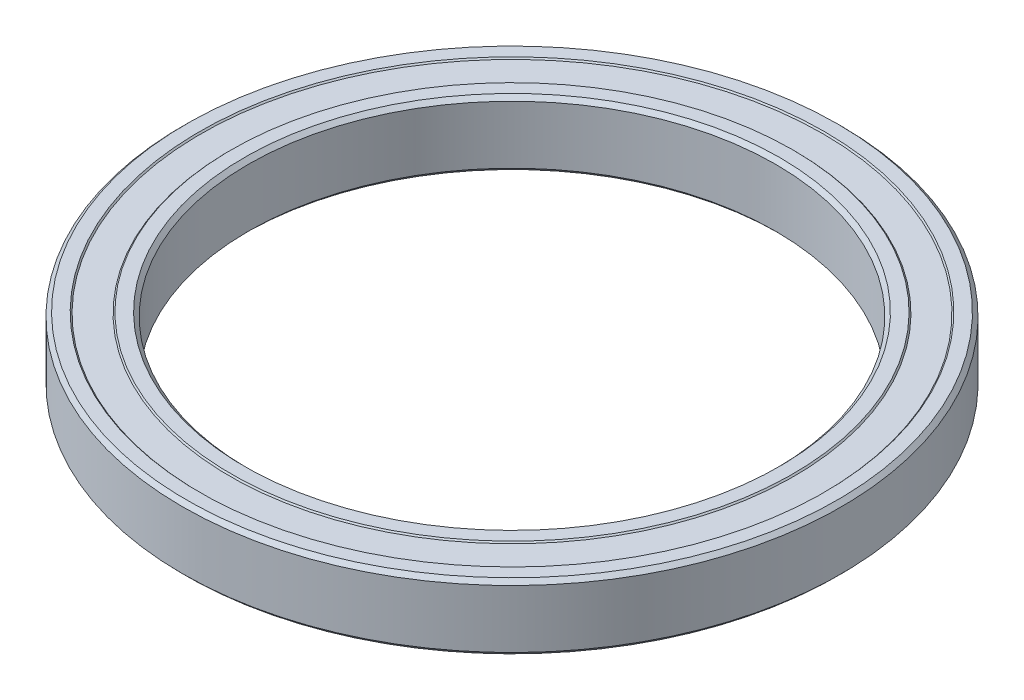
ISO-10303-21;
HEADER;
FILE_DESCRIPTION(('STEP AP214'),'2;1');
FILE_NAME('part.step','',(''),(''),'','','');
FILE_SCHEMA(('AUTOMOTIVE_DESIGN { 1 0 10303 214 1 1 1 1 }'));
ENDSEC;
DATA;
#1=APPLICATION_CONTEXT('core data for automotive mechanical design processes');
#2=APPLICATION_PROTOCOL_DEFINITION('international standard','automotive_design',2000,#1);
#3=PRODUCT_CONTEXT('',#1,'mechanical');
#4=PRODUCT('Part','Part','',(#3));
#5=PRODUCT_RELATED_PRODUCT_CATEGORY('part','',(#4));
#6=PRODUCT_DEFINITION_FORMATION('','',#4);
#7=PRODUCT_DEFINITION_CONTEXT('part definition',#1,'design');
#8=PRODUCT_DEFINITION('design','',#6,#7);
#9=PRODUCT_DEFINITION_SHAPE('','',#8);
#10=(LENGTH_UNIT() NAMED_UNIT(*) SI_UNIT(.MILLI.,.METRE.));
#11=(NAMED_UNIT(*) PLANE_ANGLE_UNIT() SI_UNIT($,.RADIAN.));
#12=(NAMED_UNIT(*) SI_UNIT($,.STERADIAN.) SOLID_ANGLE_UNIT());
#13=UNCERTAINTY_MEASURE_WITH_UNIT(LENGTH_MEASURE(1.E-05),#10,'distance_accuracy_value','');
#14=(GEOMETRIC_REPRESENTATION_CONTEXT(3) GLOBAL_UNCERTAINTY_ASSIGNED_CONTEXT((#13)) GLOBAL_UNIT_ASSIGNED_CONTEXT((#10,
#11,#12)) REPRESENTATION_CONTEXT('',''));
#15=CARTESIAN_POINT('',(0.,0.,0.));
#16=DIRECTION('',(0.,0.,1.));
#17=DIRECTION('',(1.,0.,0.));
#18=AXIS2_PLACEMENT_3D('',#15,#16,#17);
#19=CARTESIAN_POINT('',(0.,5.,0.));
#20=DIRECTION('',(0.,1.,0.));
#21=DIRECTION('',(0.,0.,1.));
#22=AXIS2_PLACEMENT_3D('',#19,#20,#21);
#23=CONICAL_SURFACE('',#22,40.6,0.785398163397448);
#24=CARTESIAN_POINT('',(0.,4.4,0.));
#25=DIRECTION('',(0.,-1.,0.));
#26=DIRECTION('',(0.,0.,-1.));
#27=AXIS2_PLACEMENT_3D('',#24,#25,#26);
#28=CIRCLE('',#27,40.);
#29=CARTESIAN_POINT('',(0.,4.4,-40.));
#30=VERTEX_POINT('',#29);
#31=EDGE_CURVE('E10',#30,#30,#28,.T.);
#32=ORIENTED_EDGE('',*,*,#31,.T.);
#33=EDGE_LOOP('',(#32));
#34=FACE_BOUND('',#33,.T.);
#35=CARTESIAN_POINT('',(0.,5.,0.));
#36=DIRECTION('',(0.,-1.,0.));
#37=DIRECTION('',(0.,0.,-1.));
#38=AXIS2_PLACEMENT_3D('',#35,#36,#37);
#39=CIRCLE('',#38,40.6);
#40=CARTESIAN_POINT('',(0.,5.,-40.6));
#41=VERTEX_POINT('',#40);
#42=EDGE_CURVE('E88',#41,#41,#39,.T.);
#43=ORIENTED_EDGE('',*,*,#42,.F.);
#44=EDGE_LOOP('',(#43));
#45=FACE_BOUND('',#44,.T.);
#46=ADVANCED_FACE('F36',(#34,#45),#23,.F.);
#47=CARTESIAN_POINT('',(0.,-1.34942197217015,0.));
#48=DIRECTION('',(0.,-1.,0.));
#49=DIRECTION('',(0.,0.,-1.));
#50=AXIS2_PLACEMENT_3D('',#47,#48,#49);
#51=CYLINDRICAL_SURFACE('',#50,40.);
#52=CARTESIAN_POINT('',(0.,-4.4,0.));
#53=DIRECTION('',(0.,-1.,0.));
#54=DIRECTION('',(0.,0.,-1.));
#55=AXIS2_PLACEMENT_3D('',#52,#53,#54);
#56=CIRCLE('',#55,40.);
#57=CARTESIAN_POINT('',(0.,-4.4,-40.));
#58=VERTEX_POINT('',#57);
#59=EDGE_CURVE('E42',#58,#58,#56,.T.);
#60=ORIENTED_EDGE('',*,*,#59,.T.);
#61=EDGE_LOOP('',(#60));
#62=FACE_BOUND('',#61,.T.);
#63=ORIENTED_EDGE('',*,*,#31,.F.);
#64=EDGE_LOOP('',(#63));
#65=FACE_BOUND('',#64,.T.);
#66=ADVANCED_FACE('F96',(#62,#65),#51,.F.);
#67=CARTESIAN_POINT('',(0.,-4.4,0.));
#68=DIRECTION('',(0.,-1.,0.));
#69=DIRECTION('',(0.,0.,-1.));
#70=AXIS2_PLACEMENT_3D('',#67,#68,#69);
#71=CONICAL_SURFACE('',#70,40.,0.78539816339745);
#72=CARTESIAN_POINT('',(0.,-5.,0.));
#73=DIRECTION('',(0.,-1.,0.));
#74=DIRECTION('',(0.,0.,-1.));
#75=AXIS2_PLACEMENT_3D('',#72,#73,#74);
#76=CIRCLE('',#75,40.6);
#77=CARTESIAN_POINT('',(0.,-5.,-40.6));
#78=VERTEX_POINT('',#77);
#79=EDGE_CURVE('E46',#78,#78,#76,.T.);
#80=ORIENTED_EDGE('',*,*,#79,.T.);
#81=EDGE_LOOP('',(#80));
#82=FACE_BOUND('',#81,.T.);
#83=ORIENTED_EDGE('',*,*,#59,.F.);
#84=EDGE_LOOP('',(#83));
#85=FACE_BOUND('',#84,.T.);
#86=ADVANCED_FACE('F100',(#82,#85),#71,.F.);
#87=CARTESIAN_POINT('',(40.6,-5.,0.));
#88=DIRECTION('',(0.,-1.,0.));
#89=DIRECTION('',(0.,0.,-1.));
#90=AXIS2_PLACEMENT_3D('',#87,#88,#89);
#91=PLANE('',#90);
#92=CARTESIAN_POINT('',(0.,-5.,0.));
#93=DIRECTION('',(0.,-1.,0.));
#94=DIRECTION('',(0.,0.,-1.));
#95=AXIS2_PLACEMENT_3D('',#92,#93,#94);
#96=CIRCLE('',#95,42.6);
#97=CARTESIAN_POINT('',(0.,-5.,-42.6));
#98=VERTEX_POINT('',#97);
#99=EDGE_CURVE('E50',#98,#98,#96,.T.);
#100=ORIENTED_EDGE('',*,*,#99,.T.);
#101=EDGE_LOOP('',(#100));
#102=FACE_BOUND('',#101,.T.);
#103=ORIENTED_EDGE('',*,*,#79,.F.);
#104=EDGE_LOOP('',(#103));
#105=FACE_BOUND('',#104,.T.);
#106=ADVANCED_FACE('F104',(#102,#105),#91,.T.);
#107=CARTESIAN_POINT('',(0.,-5.,0.));
#108=DIRECTION('',(0.,1.,0.));
#109=DIRECTION('',(0.,0.,1.));
#110=AXIS2_PLACEMENT_3D('',#107,#108,#109);
#111=CONICAL_SURFACE('',#110,42.6,0.785398163397446);
#112=CARTESIAN_POINT('',(0.,-4.8,0.));
#113=DIRECTION('',(0.,-1.,0.));
#114=DIRECTION('',(0.,0.,-1.));
#115=AXIS2_PLACEMENT_3D('',#112,#113,#114);
#116=CIRCLE('',#115,42.8);
#117=CARTESIAN_POINT('',(0.,-4.8,-42.8));
#118=VERTEX_POINT('',#117);
#119=EDGE_CURVE('E55',#118,#118,#116,.T.);
#120=ORIENTED_EDGE('',*,*,#119,.T.);
#121=EDGE_LOOP('',(#120));
#122=FACE_BOUND('',#121,.T.);
#123=ORIENTED_EDGE('',*,*,#99,.F.);
#124=EDGE_LOOP('',(#123));
#125=FACE_BOUND('',#124,.T.);
#126=ADVANCED_FACE('F111',(#122,#125),#111,.T.);
#127=CARTESIAN_POINT('',(42.8,-4.8,0.));
#128=DIRECTION('',(0.,-1.,0.));
#129=DIRECTION('',(0.,0.,-1.));
#130=AXIS2_PLACEMENT_3D('',#127,#128,#129);
#131=PLANE('',#130);
#132=CARTESIAN_POINT('',(0.,-4.8,0.));
#133=DIRECTION('',(0.,-1.,0.));
#134=DIRECTION('',(0.,0.,-1.));
#135=AXIS2_PLACEMENT_3D('',#132,#133,#134);
#136=CIRCLE('',#135,47.2);
#137=CARTESIAN_POINT('',(0.,-4.8,-47.2));
#138=VERTEX_POINT('',#137);
#139=EDGE_CURVE('E58',#138,#138,#136,.T.);
#140=ORIENTED_EDGE('',*,*,#139,.T.);
#141=EDGE_LOOP('',(#140));
#142=FACE_BOUND('',#141,.T.);
#143=ORIENTED_EDGE('',*,*,#119,.F.);
#144=EDGE_LOOP('',(#143));
#145=FACE_BOUND('',#144,.T.);
#146=ADVANCED_FACE('F115',(#142,#145),#131,.T.);
#147=CARTESIAN_POINT('',(0.,-4.8,0.));
#148=DIRECTION('',(0.,-1.,0.));
#149=DIRECTION('',(0.,0.,-1.));
#150=AXIS2_PLACEMENT_3D('',#147,#148,#149);
#151=CONICAL_SURFACE('',#150,47.2,0.785398163397444);
#152=CARTESIAN_POINT('',(0.,-5.,0.));
#153=DIRECTION('',(0.,-1.,0.));
#154=DIRECTION('',(0.,0.,-1.));
#155=AXIS2_PLACEMENT_3D('',#152,#153,#154);
#156=CIRCLE('',#155,47.4);
#157=CARTESIAN_POINT('',(0.,-5.,-47.4));
#158=VERTEX_POINT('',#157);
#159=EDGE_CURVE('E61',#158,#158,#156,.T.);
#160=ORIENTED_EDGE('',*,*,#159,.T.);
#161=EDGE_LOOP('',(#160));
#162=FACE_BOUND('',#161,.T.);
#163=ORIENTED_EDGE('',*,*,#139,.F.);
#164=EDGE_LOOP('',(#163));
#165=FACE_BOUND('',#164,.T.);
#166=ADVANCED_FACE('F119',(#162,#165),#151,.F.);
#167=CARTESIAN_POINT('',(47.4,-5.,0.));
#168=DIRECTION('',(0.,-1.,0.));
#169=DIRECTION('',(0.,0.,-1.));
#170=AXIS2_PLACEMENT_3D('',#167,#168,#169);
#171=PLANE('',#170);
#172=CARTESIAN_POINT('',(0.,-5.,0.));
#173=DIRECTION('',(0.,-1.,0.));
#174=DIRECTION('',(0.,0.,-1.));
#175=AXIS2_PLACEMENT_3D('',#172,#173,#174);
#176=CIRCLE('',#175,49.4);
#177=CARTESIAN_POINT('',(0.,-5.,-49.4));
#178=VERTEX_POINT('',#177);
#179=EDGE_CURVE('E64',#178,#178,#176,.T.);
#180=ORIENTED_EDGE('',*,*,#179,.T.);
#181=EDGE_LOOP('',(#180));
#182=FACE_BOUND('',#181,.T.);
#183=ORIENTED_EDGE('',*,*,#159,.F.);
#184=EDGE_LOOP('',(#183));
#185=FACE_BOUND('',#184,.T.);
#186=ADVANCED_FACE('F123',(#182,#185),#171,.T.);
#187=CARTESIAN_POINT('',(0.,-5.,0.));
#188=DIRECTION('',(0.,1.,0.));
#189=DIRECTION('',(0.,0.,1.));
#190=AXIS2_PLACEMENT_3D('',#187,#188,#189);
#191=CONICAL_SURFACE('',#190,49.4,0.78539816339744);
#192=CARTESIAN_POINT('',(0.,-4.39999999999999,0.));
#193=DIRECTION('',(0.,-1.,0.));
#194=DIRECTION('',(0.,0.,-1.));
#195=AXIS2_PLACEMENT_3D('',#192,#193,#194);
#196=CIRCLE('',#195,50.);
#197=CARTESIAN_POINT('',(0.,-4.39999999999999,-50.));
#198=VERTEX_POINT('',#197);
#199=EDGE_CURVE('E67',#198,#198,#196,.T.);
#200=ORIENTED_EDGE('',*,*,#199,.T.);
#201=EDGE_LOOP('',(#200));
#202=FACE_BOUND('',#201,.T.);
#203=ORIENTED_EDGE('',*,*,#179,.F.);
#204=EDGE_LOOP('',(#203));
#205=FACE_BOUND('',#204,.T.);
#206=ADVANCED_FACE('F127',(#202,#205),#191,.T.);
#207=CARTESIAN_POINT('',(0.,-1.34942197217015,0.));
#208=DIRECTION('',(0.,-1.,0.));
#209=DIRECTION('',(0.,0.,-1.));
#210=AXIS2_PLACEMENT_3D('',#207,#208,#209);
#211=CYLINDRICAL_SURFACE('',#210,50.);
#212=CARTESIAN_POINT('',(0.,4.4,0.));
#213=DIRECTION('',(0.,-1.,0.));
#214=DIRECTION('',(0.,0.,-1.));
#215=AXIS2_PLACEMENT_3D('',#212,#213,#214);
#216=CIRCLE('',#215,50.);
#217=CARTESIAN_POINT('',(0.,4.4,-50.));
#218=VERTEX_POINT('',#217);
#219=EDGE_CURVE('E70',#218,#218,#216,.T.);
#220=ORIENTED_EDGE('',*,*,#219,.T.);
#221=EDGE_LOOP('',(#220));
#222=FACE_BOUND('',#221,.T.);
#223=ORIENTED_EDGE('',*,*,#199,.F.);
#224=EDGE_LOOP('',(#223));
#225=FACE_BOUND('',#224,.T.);
#226=ADVANCED_FACE('F131',(#222,#225),#211,.T.);
#227=CARTESIAN_POINT('',(0.,4.4,0.));
#228=DIRECTION('',(0.,-1.,0.));
#229=DIRECTION('',(0.,0.,-1.));
#230=AXIS2_PLACEMENT_3D('',#227,#228,#229);
#231=CONICAL_SURFACE('',#230,50.,0.785398163397451);
#232=CARTESIAN_POINT('',(0.,5.,0.));
#233=DIRECTION('',(0.,-1.,0.));
#234=DIRECTION('',(0.,0.,-1.));
#235=AXIS2_PLACEMENT_3D('',#232,#233,#234);
#236=CIRCLE('',#235,49.4);
#237=CARTESIAN_POINT('',(0.,5.,-49.4));
#238=VERTEX_POINT('',#237);
#239=EDGE_CURVE('E73',#238,#238,#236,.T.);
#240=ORIENTED_EDGE('',*,*,#239,.T.);
#241=EDGE_LOOP('',(#240));
#242=FACE_BOUND('',#241,.T.);
#243=ORIENTED_EDGE('',*,*,#219,.F.);
#244=EDGE_LOOP('',(#243));
#245=FACE_BOUND('',#244,.T.);
#246=ADVANCED_FACE('F135',(#242,#245),#231,.T.);
#247=CARTESIAN_POINT('',(49.4,5.,0.));
#248=DIRECTION('',(0.,1.,0.));
#249=DIRECTION('',(0.,0.,1.));
#250=AXIS2_PLACEMENT_3D('',#247,#248,#249);
#251=PLANE('',#250);
#252=CARTESIAN_POINT('',(0.,5.,0.));
#253=DIRECTION('',(0.,-1.,0.));
#254=DIRECTION('',(0.,0.,-1.));
#255=AXIS2_PLACEMENT_3D('',#252,#253,#254);
#256=CIRCLE('',#255,47.4);
#257=CARTESIAN_POINT('',(0.,5.,-47.4));
#258=VERTEX_POINT('',#257);
#259=EDGE_CURVE('E76',#258,#258,#256,.T.);
#260=ORIENTED_EDGE('',*,*,#259,.T.);
#261=EDGE_LOOP('',(#260));
#262=FACE_BOUND('',#261,.T.);
#263=ORIENTED_EDGE('',*,*,#239,.F.);
#264=EDGE_LOOP('',(#263));
#265=FACE_BOUND('',#264,.T.);
#266=ADVANCED_FACE('F139',(#262,#265),#251,.T.);
#267=CARTESIAN_POINT('',(0.,5.,0.));
#268=DIRECTION('',(0.,1.,0.));
#269=DIRECTION('',(0.,0.,1.));
#270=AXIS2_PLACEMENT_3D('',#267,#268,#269);
#271=CONICAL_SURFACE('',#270,47.4,0.785398163397422);
#272=CARTESIAN_POINT('',(0.,4.8,0.));
#273=DIRECTION('',(0.,-1.,0.));
#274=DIRECTION('',(0.,0.,-1.));
#275=AXIS2_PLACEMENT_3D('',#272,#273,#274);
#276=CIRCLE('',#275,47.2);
#277=CARTESIAN_POINT('',(0.,4.8,-47.2));
#278=VERTEX_POINT('',#277);
#279=EDGE_CURVE('E79',#278,#278,#276,.T.);
#280=ORIENTED_EDGE('',*,*,#279,.T.);
#281=EDGE_LOOP('',(#280));
#282=FACE_BOUND('',#281,.T.);
#283=ORIENTED_EDGE('',*,*,#259,.F.);
#284=EDGE_LOOP('',(#283));
#285=FACE_BOUND('',#284,.T.);
#286=ADVANCED_FACE('F143',(#282,#285),#271,.F.);
#287=CARTESIAN_POINT('',(47.2,4.8,0.));
#288=DIRECTION('',(0.,1.,0.));
#289=DIRECTION('',(0.,0.,1.));
#290=AXIS2_PLACEMENT_3D('',#287,#288,#289);
#291=PLANE('',#290);
#292=CARTESIAN_POINT('',(0.,4.8,0.));
#293=DIRECTION('',(0.,-1.,0.));
#294=DIRECTION('',(0.,0.,-1.));
#295=AXIS2_PLACEMENT_3D('',#292,#293,#294);
#296=CIRCLE('',#295,42.8);
#297=CARTESIAN_POINT('',(0.,4.8,-42.8));
#298=VERTEX_POINT('',#297);
#299=EDGE_CURVE('E82',#298,#298,#296,.T.);
#300=ORIENTED_EDGE('',*,*,#299,.T.);
#301=EDGE_LOOP('',(#300));
#302=FACE_BOUND('',#301,.T.);
#303=ORIENTED_EDGE('',*,*,#279,.F.);
#304=EDGE_LOOP('',(#303));
#305=FACE_BOUND('',#304,.T.);
#306=ADVANCED_FACE('F147',(#302,#305),#291,.T.);
#307=CARTESIAN_POINT('',(0.,4.8,0.));
#308=DIRECTION('',(0.,-1.,0.));
#309=DIRECTION('',(0.,0.,-1.));
#310=AXIS2_PLACEMENT_3D('',#307,#308,#309);
#311=CONICAL_SURFACE('',#310,42.8,0.785398163397453);
#312=CARTESIAN_POINT('',(0.,5.,0.));
#313=DIRECTION('',(0.,-1.,0.));
#314=DIRECTION('',(0.,0.,-1.));
#315=AXIS2_PLACEMENT_3D('',#312,#313,#314);
#316=CIRCLE('',#315,42.6);
#317=CARTESIAN_POINT('',(0.,5.,-42.6));
#318=VERTEX_POINT('',#317);
#319=EDGE_CURVE('E85',#318,#318,#316,.T.);
#320=ORIENTED_EDGE('',*,*,#319,.T.);
#321=EDGE_LOOP('',(#320));
#322=FACE_BOUND('',#321,.T.);
#323=ORIENTED_EDGE('',*,*,#299,.F.);
#324=EDGE_LOOP('',(#323));
#325=FACE_BOUND('',#324,.T.);
#326=ADVANCED_FACE('F151',(#322,#325),#311,.T.);
#327=CARTESIAN_POINT('',(42.6,5.,0.));
#328=DIRECTION('',(0.,1.,0.));
#329=DIRECTION('',(0.,0.,1.));
#330=AXIS2_PLACEMENT_3D('',#327,#328,#329);
#331=PLANE('',#330);
#332=ORIENTED_EDGE('',*,*,#42,.T.);
#333=EDGE_LOOP('',(#332));
#334=FACE_BOUND('',#333,.T.);
#335=ORIENTED_EDGE('',*,*,#319,.F.);
#336=EDGE_LOOP('',(#335));
#337=FACE_BOUND('',#336,.T.);
#338=ADVANCED_FACE('F92',(#334,#337),#331,.T.);
#339=CLOSED_SHELL('',(#46,#66,#86,#106,#126,#146,#166,#186,#206,#226,#246,#266,#286,#306,#326,#338));
#340=MANIFOLD_SOLID_BREP('B2',#339);
#341=ADVANCED_BREP_SHAPE_REPRESENTATION('',(#18,#340),#14);
#342=SHAPE_DEFINITION_REPRESENTATION(#9,#341);
ENDSEC;
END-ISO-10303-21;
